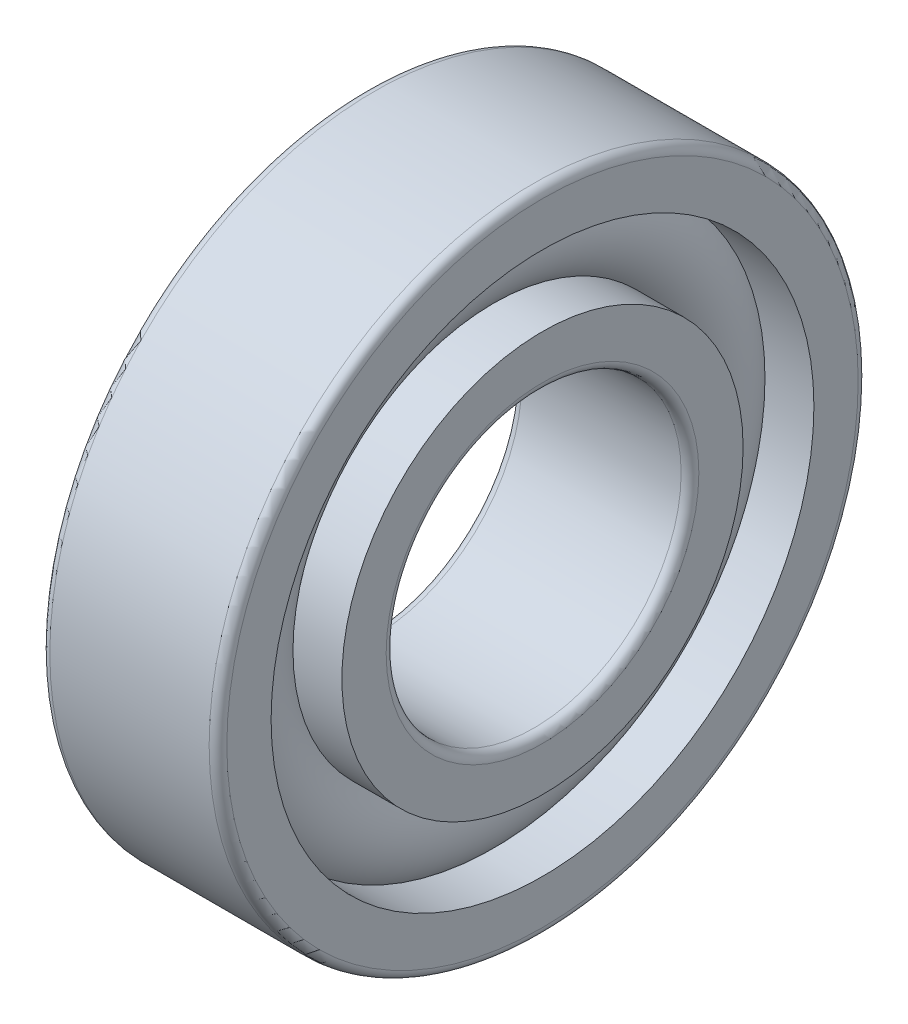
ISO-10303-21;
HEADER;
FILE_DESCRIPTION(('STEP AP214'),'2;1');
FILE_NAME('part.step','',(''),(''),'','','');
FILE_SCHEMA(('AUTOMOTIVE_DESIGN { 1 0 10303 214 1 1 1 1 }'));
ENDSEC;
DATA;
#1=APPLICATION_CONTEXT('core data for automotive mechanical design processes');
#2=APPLICATION_PROTOCOL_DEFINITION('international standard','automotive_design',2000,#1);
#3=PRODUCT_CONTEXT('',#1,'mechanical');
#4=PRODUCT('Part','Part','',(#3));
#5=PRODUCT_RELATED_PRODUCT_CATEGORY('part','',(#4));
#6=PRODUCT_DEFINITION_FORMATION('','',#4);
#7=PRODUCT_DEFINITION_CONTEXT('part definition',#1,'design');
#8=PRODUCT_DEFINITION('design','',#6,#7);
#9=PRODUCT_DEFINITION_SHAPE('','',#8);
#10=(LENGTH_UNIT() NAMED_UNIT(*) SI_UNIT(.MILLI.,.METRE.));
#11=(NAMED_UNIT(*) PLANE_ANGLE_UNIT() SI_UNIT($,.RADIAN.));
#12=(NAMED_UNIT(*) SI_UNIT($,.STERADIAN.) SOLID_ANGLE_UNIT());
#13=UNCERTAINTY_MEASURE_WITH_UNIT(LENGTH_MEASURE(1.E-05),#10,'distance_accuracy_value','');
#14=(GEOMETRIC_REPRESENTATION_CONTEXT(3) GLOBAL_UNCERTAINTY_ASSIGNED_CONTEXT((#13)) GLOBAL_UNIT_ASSIGNED_CONTEXT((#10,
#11,#12)) REPRESENTATION_CONTEXT('',''));
#15=CARTESIAN_POINT('',(0.,0.,0.));
#16=DIRECTION('',(0.,0.,1.));
#17=DIRECTION('',(1.,0.,0.));
#18=AXIS2_PLACEMENT_3D('',#15,#16,#17);
#19=CARTESIAN_POINT('',(-20.6375,0.,0.));
#20=DIRECTION('',(1.,0.,0.));
#21=DIRECTION('',(0.,0.,-1.));
#22=AXIS2_PLACEMENT_3D('',#19,#20,#21);
#23=CYLINDRICAL_SURFACE('',#22,2.5);
#24=CARTESIAN_POINT('',(1.35,0.,0.));
#25=DIRECTION('',(1.,0.,0.));
#26=DIRECTION('',(0.,0.,-1.));
#27=AXIS2_PLACEMENT_3D('',#24,#25,#26);
#28=CIRCLE('',#27,2.5);
#29=CARTESIAN_POINT('',(1.35,0.,-2.5));
#30=VERTEX_POINT('',#29);
#31=EDGE_CURVE('E67',#30,#30,#28,.F.);
#32=ORIENTED_EDGE('',*,*,#31,.F.);
#33=EDGE_LOOP('',(#32));
#34=FACE_BOUND('',#33,.T.);
#35=CARTESIAN_POINT('',(-1.35,0.,0.));
#36=DIRECTION('',(1.,0.,0.));
#37=DIRECTION('',(0.,0.,-1.));
#38=AXIS2_PLACEMENT_3D('',#35,#36,#37);
#39=CIRCLE('',#38,2.5);
#40=CARTESIAN_POINT('',(-1.35,0.,-2.5));
#41=VERTEX_POINT('',#40);
#42=EDGE_CURVE('E130',#41,#41,#39,.T.);
#43=ORIENTED_EDGE('',*,*,#42,.F.);
#44=EDGE_LOOP('',(#43));
#45=FACE_BOUND('',#44,.T.);
#46=ADVANCED_FACE('F16',(#34,#45),#23,.F.);
#47=CARTESIAN_POINT('',(-1.35,0.,0.));
#48=DIRECTION('',(1.,0.,0.));
#49=DIRECTION('',(0.,0.,-1.));
#50=AXIS2_PLACEMENT_3D('',#47,#48,#49);
#51=TOROIDAL_SURFACE('',#50,2.65,0.149999999999999);
#52=ORIENTED_EDGE('',*,*,#42,.T.);
#53=EDGE_LOOP('',(#52));
#54=FACE_BOUND('',#53,.T.);
#55=CARTESIAN_POINT('',(-1.5,0.,0.));
#56=DIRECTION('',(-1.,0.,0.));
#57=DIRECTION('',(0.,0.,-1.));
#58=AXIS2_PLACEMENT_3D('',#55,#56,#57);
#59=CIRCLE('',#58,2.65);
#60=CARTESIAN_POINT('',(-1.5,0.,2.65));
#61=VERTEX_POINT('',#60);
#62=CARTESIAN_POINT('',(-1.5,0.,-2.65));
#63=VERTEX_POINT('',#62);
#64=EDGE_CURVE('E57',#61,#63,#59,.F.);
#65=ORIENTED_EDGE('',*,*,#64,.F.);
#66=CARTESIAN_POINT('',(-1.5,0.,0.));
#67=DIRECTION('',(-1.,0.,0.));
#68=DIRECTION('',(0.,0.,1.));
#69=AXIS2_PLACEMENT_3D('',#66,#67,#68);
#70=CIRCLE('',#69,2.65);
#71=EDGE_CURVE('E55',#63,#61,#70,.F.);
#72=ORIENTED_EDGE('',*,*,#71,.F.);
#73=EDGE_LOOP('',(#65,#72));
#74=FACE_BOUND('',#73,.T.);
#75=ADVANCED_FACE('F59',(#54,#74),#51,.T.);
#76=CARTESIAN_POINT('',(1.35,0.,0.));
#77=DIRECTION('',(1.,0.,0.));
#78=DIRECTION('',(0.,0.,-1.));
#79=AXIS2_PLACEMENT_3D('',#76,#77,#78);
#80=TOROIDAL_SURFACE('',#79,2.65,0.149999999999999);
#81=CARTESIAN_POINT('',(1.5,0.,0.));
#82=DIRECTION('',(1.,0.,0.));
#83=DIRECTION('',(0.,0.,-1.));
#84=AXIS2_PLACEMENT_3D('',#81,#82,#83);
#85=CIRCLE('',#84,2.65);
#86=CARTESIAN_POINT('',(1.5,0.,2.65));
#87=VERTEX_POINT('',#86);
#88=CARTESIAN_POINT('',(1.5,0.,-2.65));
#89=VERTEX_POINT('',#88);
#90=EDGE_CURVE('E62',#87,#89,#85,.F.);
#91=ORIENTED_EDGE('',*,*,#90,.F.);
#92=CARTESIAN_POINT('',(1.5,0.,0.));
#93=DIRECTION('',(1.,0.,0.));
#94=DIRECTION('',(0.,0.,1.));
#95=AXIS2_PLACEMENT_3D('',#92,#93,#94);
#96=CIRCLE('',#95,2.65);
#97=EDGE_CURVE('E106',#89,#87,#96,.F.);
#98=ORIENTED_EDGE('',*,*,#97,.F.);
#99=EDGE_LOOP('',(#91,#98));
#100=FACE_BOUND('',#99,.T.);
#101=ORIENTED_EDGE('',*,*,#31,.T.);
#102=EDGE_LOOP('',(#101));
#103=FACE_BOUND('',#102,.T.);
#104=ADVANCED_FACE('F87',(#100,#103),#80,.T.);
#105=CARTESIAN_POINT('',(-1.5,3.4,0.));
#106=DIRECTION('',(-1.,0.,0.));
#107=DIRECTION('',(0.,0.,1.));
#108=AXIS2_PLACEMENT_3D('',#105,#106,#107);
#109=PLANE('',#108);
#110=CARTESIAN_POINT('',(-1.5,0.,0.));
#111=DIRECTION('',(1.,0.,0.));
#112=DIRECTION('',(0.,0.,-1.));
#113=AXIS2_PLACEMENT_3D('',#110,#111,#112);
#114=CIRCLE('',#113,3.4);
#115=CARTESIAN_POINT('',(-1.5,0.,-3.4));
#116=VERTEX_POINT('',#115);
#117=EDGE_CURVE('E145',#116,#116,#114,.T.);
#118=ORIENTED_EDGE('',*,*,#117,.F.);
#119=EDGE_LOOP('',(#118));
#120=FACE_BOUND('',#119,.T.);
#121=ORIENTED_EDGE('',*,*,#71,.T.);
#122=ORIENTED_EDGE('',*,*,#64,.T.);
#123=EDGE_LOOP('',(#121,#122));
#124=FACE_BOUND('',#123,.T.);
#125=ADVANCED_FACE('F66',(#120,#124),#109,.T.);
#126=CARTESIAN_POINT('',(1.5,2.65,0.));
#127=DIRECTION('',(1.,0.,0.));
#128=DIRECTION('',(0.,0.,-1.));
#129=AXIS2_PLACEMENT_3D('',#126,#127,#128);
#130=PLANE('',#129);
#131=ORIENTED_EDGE('',*,*,#90,.T.);
#132=ORIENTED_EDGE('',*,*,#97,.T.);
#133=EDGE_LOOP('',(#131,#132));
#134=FACE_BOUND('',#133,.T.);
#135=CARTESIAN_POINT('',(1.5,0.,0.));
#136=DIRECTION('',(1.,0.,0.));
#137=DIRECTION('',(0.,0.,-1.));
#138=AXIS2_PLACEMENT_3D('',#135,#136,#137);
#139=CIRCLE('',#138,3.4);
#140=CARTESIAN_POINT('',(1.5,0.,-3.4));
#141=VERTEX_POINT('',#140);
#142=EDGE_CURVE('E141',#141,#141,#139,.F.);
#143=ORIENTED_EDGE('',*,*,#142,.F.);
#144=EDGE_LOOP('',(#143));
#145=FACE_BOUND('',#144,.T.);
#146=ADVANCED_FACE('F86',(#134,#145),#130,.T.);
#147=CARTESIAN_POINT('',(-20.6375,0.,0.));
#148=DIRECTION('',(1.,0.,0.));
#149=DIRECTION('',(0.,0.,-1.));
#150=AXIS2_PLACEMENT_3D('',#147,#148,#149);
#151=CYLINDRICAL_SURFACE('',#150,3.4);
#152=ORIENTED_EDGE('',*,*,#117,.T.);
#153=EDGE_LOOP('',(#152));
#154=FACE_BOUND('',#153,.T.);
#155=CARTESIAN_POINT('',(-0.670820393249936,0.,0.));
#156=DIRECTION('',(-1.,0.,0.));
#157=DIRECTION('',(0.,0.,1.));
#158=AXIS2_PLACEMENT_3D('',#155,#156,#157);
#159=CIRCLE('',#158,3.4);
#160=CARTESIAN_POINT('',(-0.670820393249936,0.,3.4));
#161=VERTEX_POINT('',#160);
#162=EDGE_CURVE('E144',#161,#161,#159,.F.);
#163=ORIENTED_EDGE('',*,*,#162,.F.);
#164=EDGE_LOOP('',(#163));
#165=FACE_BOUND('',#164,.T.);
#166=ADVANCED_FACE('F279',(#154,#165),#151,.T.);
#167=CARTESIAN_POINT('',(-20.6375,0.,0.));
#168=DIRECTION('',(1.,0.,0.));
#169=DIRECTION('',(0.,0.,-1.));
#170=AXIS2_PLACEMENT_3D('',#167,#168,#169);
#171=CYLINDRICAL_SURFACE('',#170,3.4);
#172=CARTESIAN_POINT('',(0.670820393249936,0.,0.));
#173=DIRECTION('',(-1.,0.,0.));
#174=DIRECTION('',(0.,0.,1.));
#175=AXIS2_PLACEMENT_3D('',#172,#173,#174);
#176=CIRCLE('',#175,3.4);
#177=CARTESIAN_POINT('',(0.670820393249936,0.,3.4));
#178=VERTEX_POINT('',#177);
#179=EDGE_CURVE('E263',#178,#178,#176,.T.);
#180=ORIENTED_EDGE('',*,*,#179,.F.);
#181=EDGE_LOOP('',(#180));
#182=FACE_BOUND('',#181,.T.);
#183=ORIENTED_EDGE('',*,*,#142,.T.);
#184=EDGE_LOOP('',(#183));
#185=FACE_BOUND('',#184,.T.);
#186=ADVANCED_FACE('F258',(#182,#185),#171,.T.);
#187=CARTESIAN_POINT('',(0.,0.,0.));
#188=DIRECTION('',(-1.,0.,0.));
#189=DIRECTION('',(0.,0.,1.));
#190=AXIS2_PLACEMENT_3D('',#187,#188,#189);
#191=TOROIDAL_SURFACE('',#190,4.,0.9);
#192=CARTESIAN_POINT('',(-0.670820393249932,0.,0.));
#193=DIRECTION('',(1.,0.,0.));
#194=DIRECTION('',(0.,0.,-1.));
#195=AXIS2_PLACEMENT_3D('',#192,#193,#194);
#196=CIRCLE('',#195,4.6);
#197=CARTESIAN_POINT('',(-0.670820393249932,0.,-4.6));
#198=VERTEX_POINT('',#197);
#199=EDGE_CURVE('E262',#198,#198,#196,.F.);
#200=ORIENTED_EDGE('',*,*,#199,.T.);
#201=EDGE_LOOP('',(#200));
#202=FACE_BOUND('',#201,.T.);
#203=ORIENTED_EDGE('',*,*,#162,.T.);
#204=EDGE_LOOP('',(#203));
#205=FACE_BOUND('',#204,.T.);
#206=ADVANCED_FACE('F253',(#202,#205),#191,.T.);
#207=CARTESIAN_POINT('',(0.,0.,0.));
#208=DIRECTION('',(-1.,0.,0.));
#209=DIRECTION('',(0.,0.,1.));
#210=AXIS2_PLACEMENT_3D('',#207,#208,#209);
#211=TOROIDAL_SURFACE('',#210,4.,0.9);
#212=ORIENTED_EDGE('',*,*,#179,.T.);
#213=EDGE_LOOP('',(#212));
#214=FACE_BOUND('',#213,.T.);
#215=CARTESIAN_POINT('',(0.670820393249932,0.,0.));
#216=DIRECTION('',(1.,0.,0.));
#217=DIRECTION('',(0.,0.,-1.));
#218=AXIS2_PLACEMENT_3D('',#215,#216,#217);
#219=CIRCLE('',#218,4.6);
#220=CARTESIAN_POINT('',(0.670820393249932,0.,-4.6));
#221=VERTEX_POINT('',#220);
#222=EDGE_CURVE('E140',#221,#221,#219,.T.);
#223=ORIENTED_EDGE('',*,*,#222,.T.);
#224=EDGE_LOOP('',(#223));
#225=FACE_BOUND('',#224,.T.);
#226=ADVANCED_FACE('F248',(#214,#225),#211,.T.);
#227=CARTESIAN_POINT('',(-20.6375,0.,0.));
#228=DIRECTION('',(1.,0.,0.));
#229=DIRECTION('',(0.,0.,-1.));
#230=AXIS2_PLACEMENT_3D('',#227,#228,#229);
#231=CYLINDRICAL_SURFACE('',#230,4.6);
#232=ORIENTED_EDGE('',*,*,#199,.F.);
#233=EDGE_LOOP('',(#232));
#234=FACE_BOUND('',#233,.T.);
#235=CARTESIAN_POINT('',(-1.5,0.,0.));
#236=DIRECTION('',(1.,0.,0.));
#237=DIRECTION('',(0.,0.,-1.));
#238=AXIS2_PLACEMENT_3D('',#235,#236,#237);
#239=CIRCLE('',#238,4.6);
#240=CARTESIAN_POINT('',(-1.5,0.,-4.6));
#241=VERTEX_POINT('',#240);
#242=EDGE_CURVE('E137',#241,#241,#239,.T.);
#243=ORIENTED_EDGE('',*,*,#242,.F.);
#244=EDGE_LOOP('',(#243));
#245=FACE_BOUND('',#244,.T.);
#246=ADVANCED_FACE('F252',(#234,#245),#231,.F.);
#247=CARTESIAN_POINT('',(-20.6375,0.,0.));
#248=DIRECTION('',(1.,0.,0.));
#249=DIRECTION('',(0.,0.,-1.));
#250=AXIS2_PLACEMENT_3D('',#247,#248,#249);
#251=CYLINDRICAL_SURFACE('',#250,4.6);
#252=CARTESIAN_POINT('',(1.5,0.,0.));
#253=DIRECTION('',(1.,0.,0.));
#254=DIRECTION('',(0.,0.,-1.));
#255=AXIS2_PLACEMENT_3D('',#252,#253,#254);
#256=CIRCLE('',#255,4.6);
#257=CARTESIAN_POINT('',(1.5,0.,-4.6));
#258=VERTEX_POINT('',#257);
#259=EDGE_CURVE('E133',#258,#258,#256,.F.);
#260=ORIENTED_EDGE('',*,*,#259,.F.);
#261=EDGE_LOOP('',(#260));
#262=FACE_BOUND('',#261,.T.);
#263=ORIENTED_EDGE('',*,*,#222,.F.);
#264=EDGE_LOOP('',(#263));
#265=FACE_BOUND('',#264,.T.);
#266=ADVANCED_FACE('F335',(#262,#265),#251,.F.);
#267=CARTESIAN_POINT('',(-1.5,4.6,0.));
#268=DIRECTION('',(-1.,0.,0.));
#269=DIRECTION('',(0.,0.,1.));
#270=AXIS2_PLACEMENT_3D('',#267,#268,#269);
#271=PLANE('',#270);
#272=CARTESIAN_POINT('',(-1.5,0.,0.));
#273=DIRECTION('',(1.,0.,0.));
#274=DIRECTION('',(0.,0.,-1.));
#275=AXIS2_PLACEMENT_3D('',#272,#273,#274);
#276=CIRCLE('',#275,5.35);
#277=CARTESIAN_POINT('',(-1.5,0.,-5.35));
#278=VERTEX_POINT('',#277);
#279=CARTESIAN_POINT('',(-1.5,0.,5.35));
#280=VERTEX_POINT('',#279);
#281=EDGE_CURVE('E216',#278,#280,#276,.T.);
#282=ORIENTED_EDGE('',*,*,#281,.F.);
#283=CARTESIAN_POINT('',(-1.5,0.,0.));
#284=DIRECTION('',(1.,0.,0.));
#285=DIRECTION('',(0.,0.,1.));
#286=AXIS2_PLACEMENT_3D('',#283,#284,#285);
#287=CIRCLE('',#286,5.35);
#288=EDGE_CURVE('E136',#280,#278,#287,.T.);
#289=ORIENTED_EDGE('',*,*,#288,.F.);
#290=EDGE_LOOP('',(#282,#289));
#291=FACE_BOUND('',#290,.T.);
#292=ORIENTED_EDGE('',*,*,#242,.T.);
#293=EDGE_LOOP('',(#292));
#294=FACE_BOUND('',#293,.T.);
#295=ADVANCED_FACE('F192',(#291,#294),#271,.T.);
#296=CARTESIAN_POINT('',(1.5,5.35,0.));
#297=DIRECTION('',(1.,0.,0.));
#298=DIRECTION('',(0.,0.,-1.));
#299=AXIS2_PLACEMENT_3D('',#296,#297,#298);
#300=PLANE('',#299);
#301=ORIENTED_EDGE('',*,*,#259,.T.);
#302=EDGE_LOOP('',(#301));
#303=FACE_BOUND('',#302,.T.);
#304=CARTESIAN_POINT('',(1.5,0.,0.));
#305=DIRECTION('',(-1.,0.,0.));
#306=DIRECTION('',(0.,0.,1.));
#307=AXIS2_PLACEMENT_3D('',#304,#305,#306);
#308=CIRCLE('',#307,5.35);
#309=CARTESIAN_POINT('',(1.5,0.,5.35));
#310=VERTEX_POINT('',#309);
#311=CARTESIAN_POINT('',(1.5,0.,-5.35));
#312=VERTEX_POINT('',#311);
#313=EDGE_CURVE('E179',#310,#312,#308,.T.);
#314=ORIENTED_EDGE('',*,*,#313,.F.);
#315=CARTESIAN_POINT('',(1.5,0.,0.));
#316=DIRECTION('',(-1.,0.,0.));
#317=DIRECTION('',(0.,0.,-1.));
#318=AXIS2_PLACEMENT_3D('',#315,#316,#317);
#319=CIRCLE('',#318,5.35);
#320=EDGE_CURVE('E34',#312,#310,#319,.T.);
#321=ORIENTED_EDGE('',*,*,#320,.F.);
#322=EDGE_LOOP('',(#314,#321));
#323=FACE_BOUND('',#322,.T.);
#324=ADVANCED_FACE('F183',(#303,#323),#300,.T.);
#325=CARTESIAN_POINT('',(-1.35,0.,0.));
#326=DIRECTION('',(1.,0.,0.));
#327=DIRECTION('',(0.,0.,-1.));
#328=AXIS2_PLACEMENT_3D('',#325,#326,#327);
#329=TOROIDAL_SURFACE('',#328,5.35,0.15);
#330=CARTESIAN_POINT('',(-1.35,0.,0.));
#331=DIRECTION('',(1.,0.,0.));
#332=DIRECTION('',(0.,0.,-1.));
#333=AXIS2_PLACEMENT_3D('',#330,#331,#332);
#334=CIRCLE('',#333,5.50000000000001);
#335=CARTESIAN_POINT('',(-1.35,0.,-5.50000000000001));
#336=VERTEX_POINT('',#335);
#337=EDGE_CURVE('E26',#336,#336,#334,.T.);
#338=ORIENTED_EDGE('',*,*,#337,.F.);
#339=EDGE_LOOP('',(#338));
#340=FACE_BOUND('',#339,.T.);
#341=ORIENTED_EDGE('',*,*,#281,.T.);
#342=ORIENTED_EDGE('',*,*,#288,.T.);
#343=EDGE_LOOP('',(#341,#342));
#344=FACE_BOUND('',#343,.T.);
#345=ADVANCED_FACE('F168',(#340,#344),#329,.T.);
#346=CARTESIAN_POINT('',(1.35,0.,0.));
#347=DIRECTION('',(1.,0.,0.));
#348=DIRECTION('',(0.,0.,-1.));
#349=AXIS2_PLACEMENT_3D('',#346,#347,#348);
#350=TOROIDAL_SURFACE('',#349,5.35,0.15);
#351=ORIENTED_EDGE('',*,*,#320,.T.);
#352=ORIENTED_EDGE('',*,*,#313,.T.);
#353=EDGE_LOOP('',(#351,#352));
#354=FACE_BOUND('',#353,.T.);
#355=CARTESIAN_POINT('',(1.35,0.,0.));
#356=DIRECTION('',(1.,0.,0.));
#357=DIRECTION('',(0.,0.,-1.));
#358=AXIS2_PLACEMENT_3D('',#355,#356,#357);
#359=CIRCLE('',#358,5.50000000000001);
#360=CARTESIAN_POINT('',(1.35,0.,-5.50000000000001));
#361=VERTEX_POINT('',#360);
#362=EDGE_CURVE('E11',#361,#361,#359,.F.);
#363=ORIENTED_EDGE('',*,*,#362,.F.);
#364=EDGE_LOOP('',(#363));
#365=FACE_BOUND('',#364,.T.);
#366=ADVANCED_FACE('F156',(#354,#365),#350,.T.);
#367=CARTESIAN_POINT('',(-20.6375,0.,0.));
#368=DIRECTION('',(1.,0.,0.));
#369=DIRECTION('',(0.,0.,-1.));
#370=AXIS2_PLACEMENT_3D('',#367,#368,#369);
#371=CYLINDRICAL_SURFACE('',#370,5.50000000000001);
#372=ORIENTED_EDGE('',*,*,#362,.T.);
#373=EDGE_LOOP('',(#372));
#374=FACE_BOUND('',#373,.T.);
#375=ORIENTED_EDGE('',*,*,#337,.T.);
#376=EDGE_LOOP('',(#375));
#377=FACE_BOUND('',#376,.T.);
#378=ADVANCED_FACE('F167',(#374,#377),#371,.T.);
#379=CLOSED_SHELL('',(#46,#75,#104,#125,#146,#166,#186,#206,#226,#246,#266,#295,#324,#345,#366,#378));
#380=MANIFOLD_SOLID_BREP('B1',#379);
#381=ADVANCED_BREP_SHAPE_REPRESENTATION('',(#18,#380),#14);
#382=SHAPE_DEFINITION_REPRESENTATION(#9,#381);
ENDSEC;
END-ISO-10303-21;
